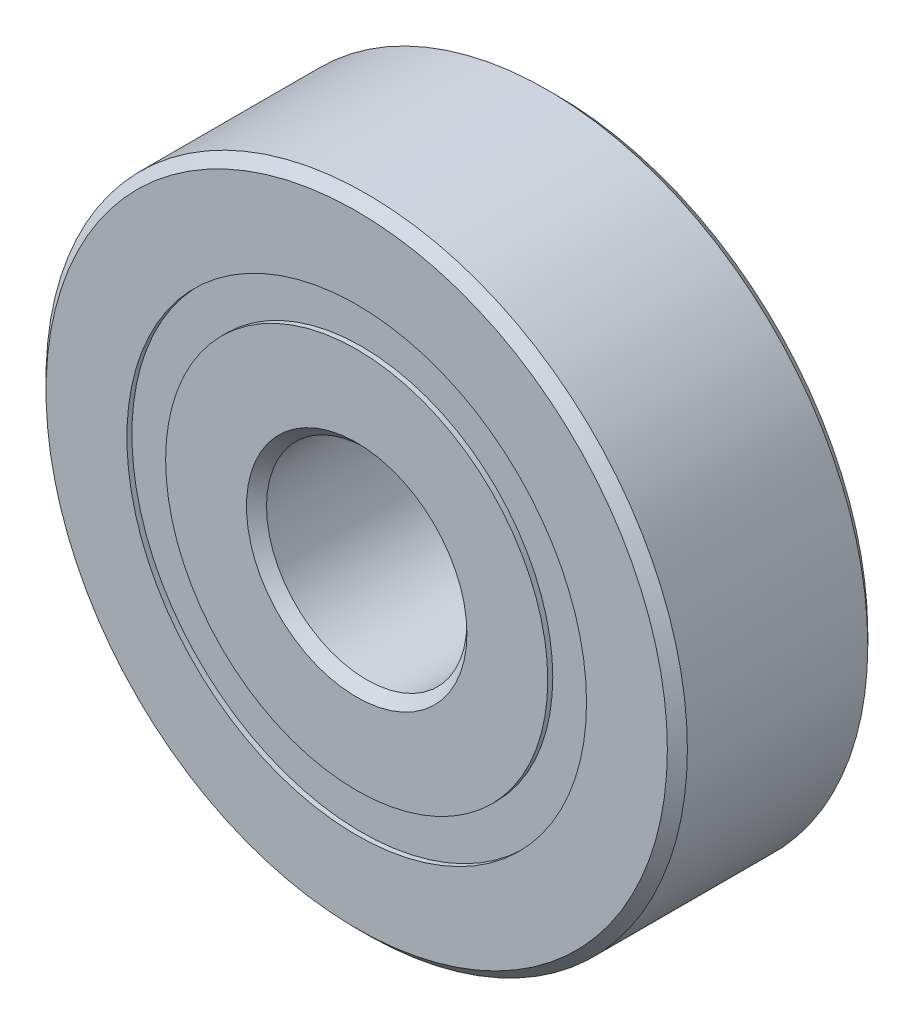
ISO-10303-21;
HEADER;
FILE_DESCRIPTION(('STEP AP214'),'2;1');
FILE_NAME('part.step','',(''),(''),'','','');
FILE_SCHEMA(('AUTOMOTIVE_DESIGN { 1 0 10303 214 1 1 1 1 }'));
ENDSEC;
DATA;
#1=APPLICATION_CONTEXT('core data for automotive mechanical design processes');
#2=APPLICATION_PROTOCOL_DEFINITION('international standard','automotive_design',2000,#1);
#3=PRODUCT_CONTEXT('',#1,'mechanical');
#4=PRODUCT('Part','Part','',(#3));
#5=PRODUCT_RELATED_PRODUCT_CATEGORY('part','',(#4));
#6=PRODUCT_DEFINITION_FORMATION('','',#4);
#7=PRODUCT_DEFINITION_CONTEXT('part definition',#1,'design');
#8=PRODUCT_DEFINITION('design','',#6,#7);
#9=PRODUCT_DEFINITION_SHAPE('','',#8);
#10=(LENGTH_UNIT() NAMED_UNIT(*) SI_UNIT(.MILLI.,.METRE.));
#11=(NAMED_UNIT(*) PLANE_ANGLE_UNIT() SI_UNIT($,.RADIAN.));
#12=(NAMED_UNIT(*) SI_UNIT($,.STERADIAN.) SOLID_ANGLE_UNIT());
#13=UNCERTAINTY_MEASURE_WITH_UNIT(LENGTH_MEASURE(1.E-05),#10,'distance_accuracy_value','');
#14=(GEOMETRIC_REPRESENTATION_CONTEXT(3) GLOBAL_UNCERTAINTY_ASSIGNED_CONTEXT((#13)) GLOBAL_UNIT_ASSIGNED_CONTEXT((#10,
#11,#12)) REPRESENTATION_CONTEXT('',''));
#15=CARTESIAN_POINT('',(0.,0.,0.));
#16=DIRECTION('',(0.,0.,1.));
#17=DIRECTION('',(1.,0.,0.));
#18=AXIS2_PLACEMENT_3D('',#15,#16,#17);
#19=CARTESIAN_POINT('',(0.,5.73351648351649,-2.375));
#20=DIRECTION('',(0.,0.,1.));
#21=DIRECTION('',(1.,0.,0.));
#22=AXIS2_PLACEMENT_3D('',#19,#20,#21);
#23=PLANE('',#22);
#24=CARTESIAN_POINT('',(0.,0.,-2.375));
#25=DIRECTION('',(0.,0.,1.));
#26=DIRECTION('',(1.,0.,0.));
#27=AXIS2_PLACEMENT_3D('',#24,#25,#26);
#28=CIRCLE('',#27,5.73351648351649);
#29=CARTESIAN_POINT('',(5.73351648351649,0.,-2.375));
#30=VERTEX_POINT('',#29);
#31=EDGE_CURVE('E56',#30,#30,#28,.T.);
#32=ORIENTED_EDGE('',*,*,#31,.F.);
#33=EDGE_LOOP('',(#32));
#34=FACE_BOUND('',#33,.T.);
#35=CARTESIAN_POINT('',(0.,0.,-2.375));
#36=DIRECTION('',(0.,0.,1.));
#37=DIRECTION('',(1.,0.,0.));
#38=AXIS2_PLACEMENT_3D('',#35,#36,#37);
#39=CIRCLE('',#38,4.76648351648352);
#40=CARTESIAN_POINT('',(4.76648351648352,0.,-2.375));
#41=VERTEX_POINT('',#40);
#42=EDGE_CURVE('E11',#41,#41,#39,.T.);
#43=ORIENTED_EDGE('',*,*,#42,.T.);
#44=EDGE_LOOP('',(#43));
#45=FACE_BOUND('',#44,.T.);
#46=ADVANCED_FACE('F42',(#34,#45),#23,.F.);
#47=CARTESIAN_POINT('',(0.,0.,2.5));
#48=DIRECTION('',(0.,0.,1.));
#49=DIRECTION('',(1.,0.,0.));
#50=AXIS2_PLACEMENT_3D('',#47,#48,#49);
#51=CYLINDRICAL_SURFACE('',#50,4.76648351648352);
#52=ORIENTED_EDGE('',*,*,#42,.F.);
#53=EDGE_LOOP('',(#52));
#54=FACE_BOUND('',#53,.T.);
#55=CARTESIAN_POINT('',(0.,0.,-1.21175743903915));
#56=DIRECTION('',(0.,0.,1.));
#57=DIRECTION('',(1.,0.,0.));
#58=AXIS2_PLACEMENT_3D('',#55,#56,#57);
#59=CIRCLE('',#58,4.76648351648352);
#60=CARTESIAN_POINT('',(4.76648351648352,0.,-1.21175743903915));
#61=VERTEX_POINT('',#60);
#62=EDGE_CURVE('E48',#61,#61,#59,.T.);
#63=ORIENTED_EDGE('',*,*,#62,.T.);
#64=EDGE_LOOP('',(#63));
#65=FACE_BOUND('',#64,.T.);
#66=ADVANCED_FACE('F65',(#54,#65),#51,.F.);
#67=CARTESIAN_POINT('',(0.,5.73351648351649,-1.21175743903915));
#68=DIRECTION('',(0.,0.,-1.));
#69=DIRECTION('',(-1.,0.,0.));
#70=AXIS2_PLACEMENT_3D('',#67,#68,#69);
#71=PLANE('',#70);
#72=ORIENTED_EDGE('',*,*,#62,.F.);
#73=EDGE_LOOP('',(#72));
#74=FACE_BOUND('',#73,.T.);
#75=CARTESIAN_POINT('',(0.,0.,-1.21175743903915));
#76=DIRECTION('',(0.,0.,1.));
#77=DIRECTION('',(1.,0.,0.));
#78=AXIS2_PLACEMENT_3D('',#75,#76,#77);
#79=CIRCLE('',#78,5.73351648351649);
#80=CARTESIAN_POINT('',(5.73351648351649,0.,-1.21175743903915));
#81=VERTEX_POINT('',#80);
#82=EDGE_CURVE('E52',#81,#81,#79,.T.);
#83=ORIENTED_EDGE('',*,*,#82,.T.);
#84=EDGE_LOOP('',(#83));
#85=FACE_BOUND('',#84,.T.);
#86=ADVANCED_FACE('F69',(#74,#85),#71,.F.);
#87=CARTESIAN_POINT('',(0.,0.,2.5));
#88=DIRECTION('',(0.,0.,1.));
#89=DIRECTION('',(1.,0.,0.));
#90=AXIS2_PLACEMENT_3D('',#87,#88,#89);
#91=CYLINDRICAL_SURFACE('',#90,5.73351648351649);
#92=ORIENTED_EDGE('',*,*,#82,.F.);
#93=EDGE_LOOP('',(#92));
#94=FACE_BOUND('',#93,.T.);
#95=ORIENTED_EDGE('',*,*,#31,.T.);
#96=EDGE_LOOP('',(#95));
#97=FACE_BOUND('',#96,.T.);
#98=ADVANCED_FACE('F62',(#94,#97),#91,.T.);
#99=CLOSED_SHELL('',(#46,#66,#86,#98));
#100=MANIFOLD_SOLID_BREP('B2',#99);
#101=CARTESIAN_POINT('',(0.,5.73351648351648,2.375));
#102=DIRECTION('',(0.,0.,-1.));
#103=DIRECTION('',(-1.,0.,0.));
#104=AXIS2_PLACEMENT_3D('',#101,#102,#103);
#105=PLANE('',#104);
#106=CARTESIAN_POINT('',(0.,0.,2.375));
#107=DIRECTION('',(0.,0.,1.));
#108=DIRECTION('',(1.,0.,0.));
#109=AXIS2_PLACEMENT_3D('',#106,#107,#108);
#110=CIRCLE('',#109,4.76648351648352);
#111=CARTESIAN_POINT('',(4.76648351648352,0.,2.375));
#112=VERTEX_POINT('',#111);
#113=EDGE_CURVE('E41',#112,#112,#110,.T.);
#114=ORIENTED_EDGE('',*,*,#113,.F.);
#115=EDGE_LOOP('',(#114));
#116=FACE_BOUND('',#115,.T.);
#117=CARTESIAN_POINT('',(0.,0.,2.375));
#118=DIRECTION('',(0.,0.,1.));
#119=DIRECTION('',(1.,0.,0.));
#120=AXIS2_PLACEMENT_3D('',#117,#118,#119);
#121=CIRCLE('',#120,5.73351648351648);
#122=CARTESIAN_POINT('',(5.73351648351648,0.,2.375));
#123=VERTEX_POINT('',#122);
#124=EDGE_CURVE('E124',#123,#123,#121,.T.);
#125=ORIENTED_EDGE('',*,*,#124,.T.);
#126=EDGE_LOOP('',(#125));
#127=FACE_BOUND('',#126,.T.);
#128=ADVANCED_FACE('F110',(#116,#127),#105,.F.);
#129=CARTESIAN_POINT('',(0.,0.,2.5));
#130=DIRECTION('',(0.,0.,1.));
#131=DIRECTION('',(1.,0.,0.));
#132=AXIS2_PLACEMENT_3D('',#129,#130,#131);
#133=CYLINDRICAL_SURFACE('',#132,4.76648351648352);
#134=CARTESIAN_POINT('',(0.,0.,1.21175743903915));
#135=DIRECTION('',(0.,0.,1.));
#136=DIRECTION('',(1.,0.,0.));
#137=AXIS2_PLACEMENT_3D('',#134,#135,#136);
#138=CIRCLE('',#137,4.76648351648352);
#139=CARTESIAN_POINT('',(4.76648351648352,0.,1.21175743903915));
#140=VERTEX_POINT('',#139);
#141=EDGE_CURVE('E116',#140,#140,#138,.T.);
#142=ORIENTED_EDGE('',*,*,#141,.F.);
#143=EDGE_LOOP('',(#142));
#144=FACE_BOUND('',#143,.T.);
#145=ORIENTED_EDGE('',*,*,#113,.T.);
#146=EDGE_LOOP('',(#145));
#147=FACE_BOUND('',#146,.T.);
#148=ADVANCED_FACE('F139',(#144,#147),#133,.F.);
#149=CARTESIAN_POINT('',(0.,5.73351648351648,1.21175743903915));
#150=DIRECTION('',(0.,0.,1.));
#151=DIRECTION('',(1.,0.,0.));
#152=AXIS2_PLACEMENT_3D('',#149,#150,#151);
#153=PLANE('',#152);
#154=CARTESIAN_POINT('',(0.,0.,1.21175743903915));
#155=DIRECTION('',(0.,0.,1.));
#156=DIRECTION('',(1.,0.,0.));
#157=AXIS2_PLACEMENT_3D('',#154,#155,#156);
#158=CIRCLE('',#157,5.73351648351648);
#159=CARTESIAN_POINT('',(5.73351648351648,0.,1.21175743903915));
#160=VERTEX_POINT('',#159);
#161=EDGE_CURVE('E120',#160,#160,#158,.T.);
#162=ORIENTED_EDGE('',*,*,#161,.F.);
#163=EDGE_LOOP('',(#162));
#164=FACE_BOUND('',#163,.T.);
#165=ORIENTED_EDGE('',*,*,#141,.T.);
#166=EDGE_LOOP('',(#165));
#167=FACE_BOUND('',#166,.T.);
#168=ADVANCED_FACE('F134',(#164,#167),#153,.F.);
#169=CARTESIAN_POINT('',(0.,0.,2.5));
#170=DIRECTION('',(0.,0.,1.));
#171=DIRECTION('',(1.,0.,0.));
#172=AXIS2_PLACEMENT_3D('',#169,#170,#171);
#173=CYLINDRICAL_SURFACE('',#172,5.73351648351648);
#174=ORIENTED_EDGE('',*,*,#124,.F.);
#175=EDGE_LOOP('',(#174));
#176=FACE_BOUND('',#175,.T.);
#177=ORIENTED_EDGE('',*,*,#161,.T.);
#178=EDGE_LOOP('',(#177));
#179=FACE_BOUND('',#178,.T.);
#180=ADVANCED_FACE('F131',(#176,#179),#173,.T.);
#181=CLOSED_SHELL('',(#128,#148,#168,#180));
#182=MANIFOLD_SOLID_BREP('B6',#181);
#183=CARTESIAN_POINT('',(-2.62499999999994,4.54663336986834,0.));
#184=DIRECTION('',(0.,0.,1.));
#185=DIRECTION('',(-0.499999999999989,0.866025403784445,0.));
#186=AXIS2_PLACEMENT_3D('',#183,#184,#185);
#187=SPHERICAL_SURFACE('',#186,1.21175743903915);
#188=CARTESIAN_POINT('',(-2.62499999999994,4.54663336986834,1.21175743903915));
#189=VERTEX_POINT('',#188);
#190=VERTEX_LOOP('',#189);
#191=FACE_BOUND('',#190,.T.);
#192=ADVANCED_FACE('F178',(#191),#187,.T.);
#193=CLOSED_SHELL('',(#192));
#194=MANIFOLD_SOLID_BREP('B36',#193);
#195=CARTESIAN_POINT('',(-4.54663336986827,2.62500000000005,0.));
#196=DIRECTION('',(0.,0.,1.));
#197=DIRECTION('',(-0.866025403784433,0.50000000000001,0.));
#198=AXIS2_PLACEMENT_3D('',#195,#196,#197);
#199=SPHERICAL_SURFACE('',#198,1.21175743903915);
#200=CARTESIAN_POINT('',(-4.54663336986827,2.62500000000005,1.21175743903915));
#201=VERTEX_POINT('',#200);
#202=VERTEX_LOOP('',#201);
#203=FACE_BOUND('',#202,.T.);
#204=ADVANCED_FACE('F199',(#203),#199,.T.);
#205=CLOSED_SHELL('',(#204));
#206=MANIFOLD_SOLID_BREP('B106',#205);
#207=CARTESIAN_POINT('',(-5.25,0.,0.));
#208=DIRECTION('',(0.,0.,1.));
#209=DIRECTION('',(-1.,0.,0.));
#210=AXIS2_PLACEMENT_3D('',#207,#208,#209);
#211=SPHERICAL_SURFACE('',#210,1.21175743903915);
#212=CARTESIAN_POINT('',(-5.25,0.,1.21175743903915));
#213=VERTEX_POINT('',#212);
#214=VERTEX_LOOP('',#213);
#215=FACE_BOUND('',#214,.T.);
#216=ADVANCED_FACE('F220',(#215),#211,.T.);
#217=CLOSED_SHELL('',(#216));
#218=MANIFOLD_SOLID_BREP('B174',#217);
#219=CARTESIAN_POINT('',(-4.54663336986833,-2.62499999999996,0.));
#220=DIRECTION('',(0.,0.,1.));
#221=DIRECTION('',(-0.866025403784443,-0.499999999999992,0.));
#222=AXIS2_PLACEMENT_3D('',#219,#220,#221);
#223=SPHERICAL_SURFACE('',#222,1.21175743903915);
#224=CARTESIAN_POINT('',(-4.54663336986833,-2.62499999999996,1.21175743903915));
#225=VERTEX_POINT('',#224);
#226=VERTEX_LOOP('',#225);
#227=FACE_BOUND('',#226,.T.);
#228=ADVANCED_FACE('F241',(#227),#223,.T.);
#229=CLOSED_SHELL('',(#228));
#230=MANIFOLD_SOLID_BREP('B195',#229);
#231=CARTESIAN_POINT('',(-2.62500000000004,-4.54663336986828,0.));
#232=DIRECTION('',(0.,0.,1.));
#233=DIRECTION('',(-0.500000000000007,-0.866025403784435,0.));
#234=AXIS2_PLACEMENT_3D('',#231,#232,#233);
#235=SPHERICAL_SURFACE('',#234,1.21175743903915);
#236=CARTESIAN_POINT('',(-2.62500000000004,-4.54663336986828,1.21175743903915));
#237=VERTEX_POINT('',#236);
#238=VERTEX_LOOP('',#237);
#239=FACE_BOUND('',#238,.T.);
#240=ADVANCED_FACE('F262',(#239),#235,.T.);
#241=CLOSED_SHELL('',(#240));
#242=MANIFOLD_SOLID_BREP('B216',#241);
#243=CARTESIAN_POINT('',(0.,-5.25,0.));
#244=DIRECTION('',(0.,0.,1.));
#245=DIRECTION('',(0.,-1.,0.));
#246=AXIS2_PLACEMENT_3D('',#243,#244,#245);
#247=SPHERICAL_SURFACE('',#246,1.21175743903915);
#248=CARTESIAN_POINT('',(0.,-5.25,1.21175743903915));
#249=VERTEX_POINT('',#248);
#250=VERTEX_LOOP('',#249);
#251=FACE_BOUND('',#250,.T.);
#252=ADVANCED_FACE('F283',(#251),#247,.T.);
#253=CLOSED_SHELL('',(#252));
#254=MANIFOLD_SOLID_BREP('B237',#253);
#255=CARTESIAN_POINT('',(2.62499999999997,-4.54663336986832,0.));
#256=DIRECTION('',(0.,0.,1.));
#257=DIRECTION('',(0.499999999999995,-0.866025403784442,0.));
#258=AXIS2_PLACEMENT_3D('',#255,#256,#257);
#259=SPHERICAL_SURFACE('',#258,1.21175743903915);
#260=CARTESIAN_POINT('',(2.62499999999997,-4.54663336986832,1.21175743903915));
#261=VERTEX_POINT('',#260);
#262=VERTEX_LOOP('',#261);
#263=FACE_BOUND('',#262,.T.);
#264=ADVANCED_FACE('F304',(#263),#259,.T.);
#265=CLOSED_SHELL('',(#264));
#266=MANIFOLD_SOLID_BREP('B258',#265);
#267=CARTESIAN_POINT('',(4.54663336986829,-2.62500000000002,0.));
#268=DIRECTION('',(0.,0.,1.));
#269=DIRECTION('',(0.866025403784436,-0.500000000000004,0.));
#270=AXIS2_PLACEMENT_3D('',#267,#268,#269);
#271=SPHERICAL_SURFACE('',#270,1.21175743903915);
#272=CARTESIAN_POINT('',(4.54663336986829,-2.62500000000002,1.21175743903915));
#273=VERTEX_POINT('',#272);
#274=VERTEX_LOOP('',#273);
#275=FACE_BOUND('',#274,.T.);
#276=ADVANCED_FACE('F325',(#275),#271,.T.);
#277=CLOSED_SHELL('',(#276));
#278=MANIFOLD_SOLID_BREP('B279',#277);
#279=CARTESIAN_POINT('',(5.25,0.,0.));
#280=DIRECTION('',(0.,0.,1.));
#281=DIRECTION('',(1.,0.,0.));
#282=AXIS2_PLACEMENT_3D('',#279,#280,#281);
#283=SPHERICAL_SURFACE('',#282,1.21175743903915);
#284=CARTESIAN_POINT('',(5.25,0.,1.21175743903915));
#285=VERTEX_POINT('',#284);
#286=VERTEX_LOOP('',#285);
#287=FACE_BOUND('',#286,.T.);
#288=ADVANCED_FACE('F346',(#287),#283,.T.);
#289=CLOSED_SHELL('',(#288));
#290=MANIFOLD_SOLID_BREP('B300',#289);
#291=CARTESIAN_POINT('',(4.54663336986831,2.62499999999999,0.));
#292=DIRECTION('',(0.,0.,1.));
#293=DIRECTION('',(0.86602540378444,0.499999999999998,0.));
#294=AXIS2_PLACEMENT_3D('',#291,#292,#293);
#295=SPHERICAL_SURFACE('',#294,1.21175743903915);
#296=CARTESIAN_POINT('',(4.54663336986831,2.62499999999999,1.21175743903915));
#297=VERTEX_POINT('',#296);
#298=VERTEX_LOOP('',#297);
#299=FACE_BOUND('',#298,.T.);
#300=ADVANCED_FACE('F367',(#299),#295,.T.);
#301=CLOSED_SHELL('',(#300));
#302=MANIFOLD_SOLID_BREP('B321',#301);
#303=CARTESIAN_POINT('',(2.62500000000001,4.5466333698683,0.));
#304=DIRECTION('',(0.,0.,1.));
#305=DIRECTION('',(0.500000000000001,0.866025403784438,0.));
#306=AXIS2_PLACEMENT_3D('',#303,#304,#305);
#307=SPHERICAL_SURFACE('',#306,1.21175743903915);
#308=CARTESIAN_POINT('',(2.62500000000001,4.5466333698683,1.21175743903915));
#309=VERTEX_POINT('',#308);
#310=VERTEX_LOOP('',#309);
#311=FACE_BOUND('',#310,.T.);
#312=ADVANCED_FACE('F388',(#311),#307,.T.);
#313=CLOSED_SHELL('',(#312));
#314=MANIFOLD_SOLID_BREP('B342',#313);
#315=CARTESIAN_POINT('',(0.,5.25,0.));
#316=DIRECTION('',(0.,0.,1.));
#317=DIRECTION('',(0.,1.,0.));
#318=AXIS2_PLACEMENT_3D('',#315,#316,#317);
#319=SPHERICAL_SURFACE('',#318,1.21175743903915);
#320=CARTESIAN_POINT('',(0.,5.25,1.21175743903915));
#321=VERTEX_POINT('',#320);
#322=VERTEX_LOOP('',#321);
#323=FACE_BOUND('',#322,.T.);
#324=ADVANCED_FACE('F411',(#323),#319,.T.);
#325=CLOSED_SHELL('',(#324));
#326=MANIFOLD_SOLID_BREP('B363',#325);
#327=CARTESIAN_POINT('',(0.,4.76648351648352,2.5));
#328=DIRECTION('',(0.,0.,-1.));
#329=DIRECTION('',(-1.,0.,0.));
#330=AXIS2_PLACEMENT_3D('',#327,#328,#329);
#331=PLANE('',#330);
#332=CARTESIAN_POINT('',(0.,0.,2.5));
#333=DIRECTION('',(0.,0.,1.));
#334=DIRECTION('',(1.,0.,0.));
#335=AXIS2_PLACEMENT_3D('',#332,#333,#334);
#336=CIRCLE('',#335,2.75);
#337=CARTESIAN_POINT('',(2.75,0.,2.5));
#338=VERTEX_POINT('',#337);
#339=EDGE_CURVE('E459',#338,#338,#336,.T.);
#340=ORIENTED_EDGE('',*,*,#339,.F.);
#341=EDGE_LOOP('',(#340));
#342=FACE_BOUND('',#341,.T.);
#343=CARTESIAN_POINT('',(0.,0.,2.5));
#344=DIRECTION('',(0.,0.,1.));
#345=DIRECTION('',(1.,0.,0.));
#346=AXIS2_PLACEMENT_3D('',#343,#344,#345);
#347=CIRCLE('',#346,4.76648351648352);
#348=CARTESIAN_POINT('',(4.76648351648352,0.,2.5));
#349=VERTEX_POINT('',#348);
#350=EDGE_CURVE('E410',#349,#349,#347,.T.);
#351=ORIENTED_EDGE('',*,*,#350,.T.);
#352=EDGE_LOOP('',(#351));
#353=FACE_BOUND('',#352,.T.);
#354=ADVANCED_FACE('F431',(#342,#353),#331,.F.);
#355=CARTESIAN_POINT('',(0.,0.,2.5));
#356=DIRECTION('',(0.,0.,1.));
#357=DIRECTION('',(1.,0.,0.));
#358=AXIS2_PLACEMENT_3D('',#355,#356,#357);
#359=CYLINDRICAL_SURFACE('',#358,4.76648351648352);
#360=ORIENTED_EDGE('',*,*,#350,.F.);
#361=EDGE_LOOP('',(#360));
#362=FACE_BOUND('',#361,.T.);
#363=CARTESIAN_POINT('',(0.,0.,1.11111111111111));
#364=DIRECTION('',(0.,0.,1.));
#365=DIRECTION('',(1.,0.,0.));
#366=AXIS2_PLACEMENT_3D('',#363,#364,#365);
#367=CIRCLE('',#366,4.76648351648352);
#368=CARTESIAN_POINT('',(4.76648351648352,0.,1.11111111111111));
#369=VERTEX_POINT('',#368);
#370=EDGE_CURVE('E437',#369,#369,#367,.T.);
#371=ORIENTED_EDGE('',*,*,#370,.T.);
#372=EDGE_LOOP('',(#371));
#373=FACE_BOUND('',#372,.T.);
#374=ADVANCED_FACE('F466',(#362,#373),#359,.T.);
#375=CARTESIAN_POINT('',(0.,0.,0.));
#376=DIRECTION('',(0.,0.,1.));
#377=DIRECTION('',(1.,0.,0.));
#378=AXIS2_PLACEMENT_3D('',#375,#376,#377);
#379=TOROIDAL_SURFACE('',#378,5.25,1.21175743903915);
#380=ORIENTED_EDGE('',*,*,#370,.F.);
#381=EDGE_LOOP('',(#380));
#382=FACE_BOUND('',#381,.T.);
#383=CARTESIAN_POINT('',(0.,0.,-1.11111111111111));
#384=DIRECTION('',(0.,0.,1.));
#385=DIRECTION('',(1.,0.,0.));
#386=AXIS2_PLACEMENT_3D('',#383,#384,#385);
#387=CIRCLE('',#386,4.76648351648352);
#388=CARTESIAN_POINT('',(4.76648351648352,0.,-1.11111111111111));
#389=VERTEX_POINT('',#388);
#390=EDGE_CURVE('E441',#389,#389,#387,.T.);
#391=ORIENTED_EDGE('',*,*,#390,.T.);
#392=EDGE_LOOP('',(#391));
#393=FACE_BOUND('',#392,.T.);
#394=ADVANCED_FACE('F470',(#382,#393),#379,.F.);
#395=CARTESIAN_POINT('',(0.,0.,2.5));
#396=DIRECTION('',(0.,0.,1.));
#397=DIRECTION('',(1.,0.,0.));
#398=AXIS2_PLACEMENT_3D('',#395,#396,#397);
#399=CYLINDRICAL_SURFACE('',#398,4.76648351648352);
#400=ORIENTED_EDGE('',*,*,#390,.F.);
#401=EDGE_LOOP('',(#400));
#402=FACE_BOUND('',#401,.T.);
#403=CARTESIAN_POINT('',(0.,0.,-2.5));
#404=DIRECTION('',(0.,0.,1.));
#405=DIRECTION('',(1.,0.,0.));
#406=AXIS2_PLACEMENT_3D('',#403,#404,#405);
#407=CIRCLE('',#406,4.76648351648352);
#408=CARTESIAN_POINT('',(4.76648351648352,0.,-2.5));
#409=VERTEX_POINT('',#408);
#410=EDGE_CURVE('E445',#409,#409,#407,.T.);
#411=ORIENTED_EDGE('',*,*,#410,.T.);
#412=EDGE_LOOP('',(#411));
#413=FACE_BOUND('',#412,.T.);
#414=ADVANCED_FACE('F475',(#402,#413),#399,.T.);
#415=CARTESIAN_POINT('',(0.,2.75,-2.5));
#416=DIRECTION('',(0.,0.,1.));
#417=DIRECTION('',(1.,0.,0.));
#418=AXIS2_PLACEMENT_3D('',#415,#416,#417);
#419=PLANE('',#418);
#420=ORIENTED_EDGE('',*,*,#410,.F.);
#421=EDGE_LOOP('',(#420));
#422=FACE_BOUND('',#421,.T.);
#423=CARTESIAN_POINT('',(0.,0.,-2.5));
#424=DIRECTION('',(0.,0.,1.));
#425=DIRECTION('',(1.,0.,0.));
#426=AXIS2_PLACEMENT_3D('',#423,#424,#425);
#427=CIRCLE('',#426,2.75);
#428=CARTESIAN_POINT('',(2.75,0.,-2.5));
#429=VERTEX_POINT('',#428);
#430=EDGE_CURVE('E450',#429,#429,#427,.T.);
#431=ORIENTED_EDGE('',*,*,#430,.T.);
#432=EDGE_LOOP('',(#431));
#433=FACE_BOUND('',#432,.T.);
#434=ADVANCED_FACE('F481',(#422,#433),#419,.F.);
#435=CARTESIAN_POINT('',(0.,0.,-2.25));
#436=DIRECTION('',(0.,0.,-1.));
#437=DIRECTION('',(-1.,0.,0.));
#438=AXIS2_PLACEMENT_3D('',#435,#436,#437);
#439=CONICAL_SURFACE('',#438,2.5,0.785398163397447);
#440=ORIENTED_EDGE('',*,*,#430,.F.);
#441=EDGE_LOOP('',(#440));
#442=FACE_BOUND('',#441,.T.);
#443=CARTESIAN_POINT('',(0.,0.,-2.25));
#444=DIRECTION('',(0.,0.,1.));
#445=DIRECTION('',(1.,0.,0.));
#446=AXIS2_PLACEMENT_3D('',#443,#444,#445);
#447=CIRCLE('',#446,2.5);
#448=CARTESIAN_POINT('',(2.5,0.,-2.25));
#449=VERTEX_POINT('',#448);
#450=EDGE_CURVE('E453',#449,#449,#447,.T.);
#451=ORIENTED_EDGE('',*,*,#450,.T.);
#452=EDGE_LOOP('',(#451));
#453=FACE_BOUND('',#452,.T.);
#454=ADVANCED_FACE('F485',(#442,#453),#439,.F.);
#455=CARTESIAN_POINT('',(0.,0.,2.5));
#456=DIRECTION('',(0.,0.,1.));
#457=DIRECTION('',(1.,0.,0.));
#458=AXIS2_PLACEMENT_3D('',#455,#456,#457);
#459=CYLINDRICAL_SURFACE('',#458,2.5);
#460=ORIENTED_EDGE('',*,*,#450,.F.);
#461=EDGE_LOOP('',(#460));
#462=FACE_BOUND('',#461,.T.);
#463=CARTESIAN_POINT('',(0.,0.,2.25));
#464=DIRECTION('',(0.,0.,1.));
#465=DIRECTION('',(1.,0.,0.));
#466=AXIS2_PLACEMENT_3D('',#463,#464,#465);
#467=CIRCLE('',#466,2.5);
#468=CARTESIAN_POINT('',(2.5,0.,2.25));
#469=VERTEX_POINT('',#468);
#470=EDGE_CURVE('E456',#469,#469,#467,.T.);
#471=ORIENTED_EDGE('',*,*,#470,.T.);
#472=EDGE_LOOP('',(#471));
#473=FACE_BOUND('',#472,.T.);
#474=ADVANCED_FACE('F489',(#462,#473),#459,.F.);
#475=CARTESIAN_POINT('',(0.,0.,2.5));
#476=DIRECTION('',(0.,0.,1.));
#477=DIRECTION('',(1.,0.,0.));
#478=AXIS2_PLACEMENT_3D('',#475,#476,#477);
#479=CONICAL_SURFACE('',#478,2.75,0.785398163397452);
#480=ORIENTED_EDGE('',*,*,#470,.F.);
#481=EDGE_LOOP('',(#480));
#482=FACE_BOUND('',#481,.T.);
#483=ORIENTED_EDGE('',*,*,#339,.T.);
#484=EDGE_LOOP('',(#483));
#485=FACE_BOUND('',#484,.T.);
#486=ADVANCED_FACE('F463',(#482,#485),#479,.F.);
#487=CLOSED_SHELL('',(#354,#374,#394,#414,#434,#454,#474,#486));
#488=MANIFOLD_SOLID_BREP('B384',#487);
#489=CARTESIAN_POINT('',(0.,0.,2.25));
#490=DIRECTION('',(0.,0.,-1.));
#491=DIRECTION('',(-1.,0.,0.));
#492=AXIS2_PLACEMENT_3D('',#489,#490,#491);
#493=CONICAL_SURFACE('',#492,8.,0.785398163397448);
#494=CARTESIAN_POINT('',(0.,0.,2.5));
#495=DIRECTION('',(0.,0.,1.));
#496=DIRECTION('',(1.,0.,0.));
#497=AXIS2_PLACEMENT_3D('',#494,#495,#496);
#498=CIRCLE('',#497,7.75);
#499=CARTESIAN_POINT('',(7.75,0.,2.5));
#500=VERTEX_POINT('',#499);
#501=EDGE_CURVE('E581',#500,#500,#498,.T.);
#502=ORIENTED_EDGE('',*,*,#501,.F.);
#503=EDGE_LOOP('',(#502));
#504=FACE_BOUND('',#503,.T.);
#505=CARTESIAN_POINT('',(0.,0.,2.25));
#506=DIRECTION('',(0.,0.,1.));
#507=DIRECTION('',(1.,0.,0.));
#508=AXIS2_PLACEMENT_3D('',#505,#506,#507);
#509=CIRCLE('',#508,8.);
#510=CARTESIAN_POINT('',(8.,0.,2.25));
#511=VERTEX_POINT('',#510);
#512=EDGE_CURVE('E430',#511,#511,#509,.T.);
#513=ORIENTED_EDGE('',*,*,#512,.T.);
#514=EDGE_LOOP('',(#513));
#515=FACE_BOUND('',#514,.T.);
#516=ADVANCED_FACE('F553',(#504,#515),#493,.T.);
#517=CARTESIAN_POINT('',(0.,0.,2.5));
#518=DIRECTION('',(0.,0.,1.));
#519=DIRECTION('',(1.,0.,0.));
#520=AXIS2_PLACEMENT_3D('',#517,#518,#519);
#521=CYLINDRICAL_SURFACE('',#520,8.);
#522=ORIENTED_EDGE('',*,*,#512,.F.);
#523=EDGE_LOOP('',(#522));
#524=FACE_BOUND('',#523,.T.);
#525=CARTESIAN_POINT('',(0.,0.,-2.25));
#526=DIRECTION('',(0.,0.,1.));
#527=DIRECTION('',(1.,0.,0.));
#528=AXIS2_PLACEMENT_3D('',#525,#526,#527);
#529=CIRCLE('',#528,8.);
#530=CARTESIAN_POINT('',(8.,0.,-2.25));
#531=VERTEX_POINT('',#530);
#532=EDGE_CURVE('E559',#531,#531,#529,.T.);
#533=ORIENTED_EDGE('',*,*,#532,.T.);
#534=EDGE_LOOP('',(#533));
#535=FACE_BOUND('',#534,.T.);
#536=ADVANCED_FACE('F588',(#524,#535),#521,.T.);
#537=CARTESIAN_POINT('',(0.,0.,-2.5));
#538=DIRECTION('',(0.,0.,1.));
#539=DIRECTION('',(1.,0.,0.));
#540=AXIS2_PLACEMENT_3D('',#537,#538,#539);
#541=CONICAL_SURFACE('',#540,7.75,0.785398163397447);
#542=ORIENTED_EDGE('',*,*,#532,.F.);
#543=EDGE_LOOP('',(#542));
#544=FACE_BOUND('',#543,.T.);
#545=CARTESIAN_POINT('',(0.,0.,-2.5));
#546=DIRECTION('',(0.,0.,1.));
#547=DIRECTION('',(1.,0.,0.));
#548=AXIS2_PLACEMENT_3D('',#545,#546,#547);
#549=CIRCLE('',#548,7.75);
#550=CARTESIAN_POINT('',(7.75,0.,-2.5));
#551=VERTEX_POINT('',#550);
#552=EDGE_CURVE('E563',#551,#551,#549,.T.);
#553=ORIENTED_EDGE('',*,*,#552,.T.);
#554=EDGE_LOOP('',(#553));
#555=FACE_BOUND('',#554,.T.);
#556=ADVANCED_FACE('F592',(#544,#555),#541,.T.);
#557=CARTESIAN_POINT('',(0.,7.75,-2.5));
#558=DIRECTION('',(0.,0.,1.));
#559=DIRECTION('',(1.,0.,0.));
#560=AXIS2_PLACEMENT_3D('',#557,#558,#559);
#561=PLANE('',#560);
#562=ORIENTED_EDGE('',*,*,#552,.F.);
#563=EDGE_LOOP('',(#562));
#564=FACE_BOUND('',#563,.T.);
#565=CARTESIAN_POINT('',(0.,0.,-2.5));
#566=DIRECTION('',(0.,0.,1.));
#567=DIRECTION('',(1.,0.,0.));
#568=AXIS2_PLACEMENT_3D('',#565,#566,#567);
#569=CIRCLE('',#568,5.73351648351649);
#570=CARTESIAN_POINT('',(5.73351648351649,0.,-2.5));
#571=VERTEX_POINT('',#570);
#572=EDGE_CURVE('E567',#571,#571,#569,.T.);
#573=ORIENTED_EDGE('',*,*,#572,.T.);
#574=EDGE_LOOP('',(#573));
#575=FACE_BOUND('',#574,.T.);
#576=ADVANCED_FACE('F597',(#564,#575),#561,.F.);
#577=CARTESIAN_POINT('',(0.,0.,2.5));
#578=DIRECTION('',(0.,0.,1.));
#579=DIRECTION('',(1.,0.,0.));
#580=AXIS2_PLACEMENT_3D('',#577,#578,#579);
#581=CYLINDRICAL_SURFACE('',#580,5.73351648351648);
#582=ORIENTED_EDGE('',*,*,#572,.F.);
#583=EDGE_LOOP('',(#582));
#584=FACE_BOUND('',#583,.T.);
#585=CARTESIAN_POINT('',(0.,0.,-1.11111111111111));
#586=DIRECTION('',(0.,0.,1.));
#587=DIRECTION('',(1.,0.,0.));
#588=AXIS2_PLACEMENT_3D('',#585,#586,#587);
#589=CIRCLE('',#588,5.73351648351648);
#590=CARTESIAN_POINT('',(5.73351648351648,0.,-1.11111111111111));
#591=VERTEX_POINT('',#590);
#592=EDGE_CURVE('E572',#591,#591,#589,.T.);
#593=ORIENTED_EDGE('',*,*,#592,.T.);
#594=EDGE_LOOP('',(#593));
#595=FACE_BOUND('',#594,.T.);
#596=ADVANCED_FACE('F603',(#584,#595),#581,.F.);
#597=CARTESIAN_POINT('',(0.,0.,0.));
#598=DIRECTION('',(0.,0.,1.));
#599=DIRECTION('',(1.,0.,0.));
#600=AXIS2_PLACEMENT_3D('',#597,#598,#599);
#601=TOROIDAL_SURFACE('',#600,5.25,1.21175743903915);
#602=ORIENTED_EDGE('',*,*,#592,.F.);
#603=EDGE_LOOP('',(#602));
#604=FACE_BOUND('',#603,.T.);
#605=CARTESIAN_POINT('',(0.,0.,1.11111111111111));
#606=DIRECTION('',(0.,0.,1.));
#607=DIRECTION('',(1.,0.,0.));
#608=AXIS2_PLACEMENT_3D('',#605,#606,#607);
#609=CIRCLE('',#608,5.73351648351648);
#610=CARTESIAN_POINT('',(5.73351648351648,0.,1.11111111111111));
#611=VERTEX_POINT('',#610);
#612=EDGE_CURVE('E575',#611,#611,#609,.T.);
#613=ORIENTED_EDGE('',*,*,#612,.T.);
#614=EDGE_LOOP('',(#613));
#615=FACE_BOUND('',#614,.T.);
#616=ADVANCED_FACE('F607',(#604,#615),#601,.F.);
#617=CARTESIAN_POINT('',(0.,0.,2.5));
#618=DIRECTION('',(0.,0.,1.));
#619=DIRECTION('',(1.,0.,0.));
#620=AXIS2_PLACEMENT_3D('',#617,#618,#619);
#621=CYLINDRICAL_SURFACE('',#620,5.73351648351648);
#622=ORIENTED_EDGE('',*,*,#612,.F.);
#623=EDGE_LOOP('',(#622));
#624=FACE_BOUND('',#623,.T.);
#625=CARTESIAN_POINT('',(0.,0.,2.5));
#626=DIRECTION('',(0.,0.,1.));
#627=DIRECTION('',(1.,0.,0.));
#628=AXIS2_PLACEMENT_3D('',#625,#626,#627);
#629=CIRCLE('',#628,5.73351648351648);
#630=CARTESIAN_POINT('',(5.73351648351648,0.,2.5));
#631=VERTEX_POINT('',#630);
#632=EDGE_CURVE('E578',#631,#631,#629,.T.);
#633=ORIENTED_EDGE('',*,*,#632,.T.);
#634=EDGE_LOOP('',(#633));
#635=FACE_BOUND('',#634,.T.);
#636=ADVANCED_FACE('F611',(#624,#635),#621,.F.);
#637=CARTESIAN_POINT('',(0.,7.75,2.5));
#638=DIRECTION('',(0.,0.,-1.));
#639=DIRECTION('',(-1.,0.,0.));
#640=AXIS2_PLACEMENT_3D('',#637,#638,#639);
#641=PLANE('',#640);
#642=ORIENTED_EDGE('',*,*,#632,.F.);
#643=EDGE_LOOP('',(#642));
#644=FACE_BOUND('',#643,.T.);
#645=ORIENTED_EDGE('',*,*,#501,.T.);
#646=EDGE_LOOP('',(#645));
#647=FACE_BOUND('',#646,.T.);
#648=ADVANCED_FACE('F585',(#644,#647),#641,.F.);
#649=CLOSED_SHELL('',(#516,#536,#556,#576,#596,#616,#636,#648));
#650=MANIFOLD_SOLID_BREP('B405',#649);
#651=ADVANCED_BREP_SHAPE_REPRESENTATION('',(#18,#100,#182,#194,#206,#218,#230,#242,#254,#266,
#278,#290,#302,#314,#326,#488,#650),#14);
#652=SHAPE_DEFINITION_REPRESENTATION(#9,#651);
ENDSEC;
END-ISO-10303-21;
